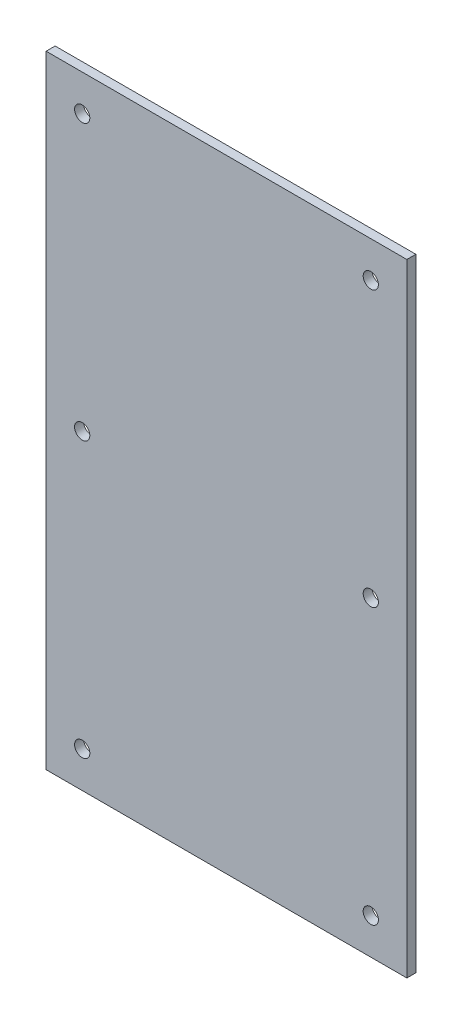
ISO-10303-21;
HEADER;
FILE_DESCRIPTION(('STEP AP214'),'2;1');
FILE_NAME('part.step','',(''),(''),'','','');
FILE_SCHEMA(('AUTOMOTIVE_DESIGN { 1 0 10303 214 1 1 1 1 }'));
ENDSEC;
DATA;
#1=APPLICATION_CONTEXT('core data for automotive mechanical design processes');
#2=APPLICATION_PROTOCOL_DEFINITION('international standard','automotive_design',2000,#1);
#3=PRODUCT_CONTEXT('',#1,'mechanical');
#4=PRODUCT('Part','Part','',(#3));
#5=PRODUCT_RELATED_PRODUCT_CATEGORY('part','',(#4));
#6=PRODUCT_DEFINITION_FORMATION('','',#4);
#7=PRODUCT_DEFINITION_CONTEXT('part definition',#1,'design');
#8=PRODUCT_DEFINITION('design','',#6,#7);
#9=PRODUCT_DEFINITION_SHAPE('','',#8);
#10=(LENGTH_UNIT() NAMED_UNIT(*) SI_UNIT(.MILLI.,.METRE.));
#11=(NAMED_UNIT(*) PLANE_ANGLE_UNIT() SI_UNIT($,.RADIAN.));
#12=(NAMED_UNIT(*) SI_UNIT($,.STERADIAN.) SOLID_ANGLE_UNIT());
#13=UNCERTAINTY_MEASURE_WITH_UNIT(LENGTH_MEASURE(1.E-05),#10,'distance_accuracy_value','');
#14=(GEOMETRIC_REPRESENTATION_CONTEXT(3) GLOBAL_UNCERTAINTY_ASSIGNED_CONTEXT((#13)) GLOBAL_UNIT_ASSIGNED_CONTEXT((#10,
#11,#12)) REPRESENTATION_CONTEXT('',''));
#15=CARTESIAN_POINT('',(0.,0.,0.));
#16=DIRECTION('',(0.,0.,1.));
#17=DIRECTION('',(1.,0.,0.));
#18=AXIS2_PLACEMENT_3D('',#15,#16,#17);
#19=CARTESIAN_POINT('',(127.,219.075,6.35));
#20=DIRECTION('',(-1.,0.,0.));
#21=DIRECTION('',(0.,-1.,0.));
#22=AXIS2_PLACEMENT_3D('',#19,#20,#21);
#23=PLANE('',#22);
#24=DIRECTION('',(0.,1.,0.));
#25=VECTOR('',#24,1.);
#26=CARTESIAN_POINT('',(127.,219.075,0.));
#27=LINE('',#26,#25);
#28=CARTESIAN_POINT('',(127.,-219.075,0.));
#29=VERTEX_POINT('',#28);
#30=CARTESIAN_POINT('',(127.,219.075,0.));
#31=VERTEX_POINT('',#30);
#32=EDGE_CURVE('E97',#29,#31,#27,.T.);
#33=ORIENTED_EDGE('',*,*,#32,.T.);
#34=DIRECTION('',(0.,0.,-1.));
#35=VECTOR('',#34,1.);
#36=CARTESIAN_POINT('',(127.,219.075,6.35));
#37=LINE('',#36,#35);
#38=CARTESIAN_POINT('',(127.,219.075,6.35));
#39=VERTEX_POINT('',#38);
#40=EDGE_CURVE('E11',#39,#31,#37,.T.);
#41=ORIENTED_EDGE('',*,*,#40,.F.);
#42=DIRECTION('',(0.,1.,0.));
#43=VECTOR('',#42,1.);
#44=CARTESIAN_POINT('',(127.,219.075,6.35));
#45=LINE('',#44,#43);
#46=CARTESIAN_POINT('',(127.,-219.075,6.35));
#47=VERTEX_POINT('',#46);
#48=EDGE_CURVE('E85',#47,#39,#45,.T.);
#49=ORIENTED_EDGE('',*,*,#48,.F.);
#50=DIRECTION('',(0.,0.,-1.));
#51=VECTOR('',#50,1.);
#52=CARTESIAN_POINT('',(127.,-219.075,6.35));
#53=LINE('',#52,#51);
#54=EDGE_CURVE('E93',#47,#29,#53,.T.);
#55=ORIENTED_EDGE('',*,*,#54,.T.);
#56=EDGE_LOOP('',(#33,#41,#49,#55));
#57=FACE_BOUND('',#56,.T.);
#58=ADVANCED_FACE('F34',(#57),#23,.F.);
#59=CARTESIAN_POINT('',(-127.,219.075,6.35));
#60=DIRECTION('',(0.,-1.,0.));
#61=DIRECTION('',(0.,0.,-1.));
#62=AXIS2_PLACEMENT_3D('',#59,#60,#61);
#63=PLANE('',#62);
#64=DIRECTION('',(-1.,0.,0.));
#65=VECTOR('',#64,1.);
#66=CARTESIAN_POINT('',(-127.,219.075,0.));
#67=LINE('',#66,#65);
#68=CARTESIAN_POINT('',(-127.,219.075,0.));
#69=VERTEX_POINT('',#68);
#70=EDGE_CURVE('E89',#31,#69,#67,.T.);
#71=ORIENTED_EDGE('',*,*,#70,.T.);
#72=DIRECTION('',(0.,0.,-1.));
#73=VECTOR('',#72,1.);
#74=CARTESIAN_POINT('',(-127.,219.075,6.35));
#75=LINE('',#74,#73);
#76=CARTESIAN_POINT('',(-127.,219.075,6.35));
#77=VERTEX_POINT('',#76);
#78=EDGE_CURVE('E42',#77,#69,#75,.T.);
#79=ORIENTED_EDGE('',*,*,#78,.F.);
#80=DIRECTION('',(-1.,0.,0.));
#81=VECTOR('',#80,1.);
#82=CARTESIAN_POINT('',(-127.,219.075,6.35));
#83=LINE('',#82,#81);
#84=EDGE_CURVE('E80',#39,#77,#83,.T.);
#85=ORIENTED_EDGE('',*,*,#84,.F.);
#86=ORIENTED_EDGE('',*,*,#40,.T.);
#87=EDGE_LOOP('',(#71,#79,#85,#86));
#88=FACE_BOUND('',#87,.T.);
#89=ADVANCED_FACE('F88',(#88),#63,.F.);
#90=CARTESIAN_POINT('',(-127.,219.075,6.35));
#91=DIRECTION('',(1.,0.,0.));
#92=DIRECTION('',(0.,1.,0.));
#93=AXIS2_PLACEMENT_3D('',#90,#91,#92);
#94=PLANE('',#93);
#95=DIRECTION('',(0.,-1.,0.));
#96=VECTOR('',#95,1.);
#97=CARTESIAN_POINT('',(-127.,219.075,0.));
#98=LINE('',#97,#96);
#99=CARTESIAN_POINT('',(-127.,-219.075,0.));
#100=VERTEX_POINT('',#99);
#101=EDGE_CURVE('E67',#69,#100,#98,.T.);
#102=ORIENTED_EDGE('',*,*,#101,.T.);
#103=DIRECTION('',(0.,0.,-1.));
#104=VECTOR('',#103,1.);
#105=CARTESIAN_POINT('',(-127.,-219.075,6.35));
#106=LINE('',#105,#104);
#107=CARTESIAN_POINT('',(-127.,-219.075,6.35));
#108=VERTEX_POINT('',#107);
#109=EDGE_CURVE('E90',#108,#100,#106,.T.);
#110=ORIENTED_EDGE('',*,*,#109,.F.);
#111=DIRECTION('',(0.,-1.,0.));
#112=VECTOR('',#111,1.);
#113=CARTESIAN_POINT('',(-127.,219.075,6.35));
#114=LINE('',#113,#112);
#115=EDGE_CURVE('E83',#77,#108,#114,.T.);
#116=ORIENTED_EDGE('',*,*,#115,.F.);
#117=ORIENTED_EDGE('',*,*,#78,.T.);
#118=EDGE_LOOP('',(#102,#110,#116,#117));
#119=FACE_BOUND('',#118,.T.);
#120=ADVANCED_FACE('F91',(#119),#94,.F.);
#121=CARTESIAN_POINT('',(-127.,-219.075,6.35));
#122=DIRECTION('',(0.,1.,0.));
#123=DIRECTION('',(0.,0.,1.));
#124=AXIS2_PLACEMENT_3D('',#121,#122,#123);
#125=PLANE('',#124);
#126=DIRECTION('',(1.,0.,0.));
#127=VECTOR('',#126,1.);
#128=CARTESIAN_POINT('',(-127.,-219.075,0.));
#129=LINE('',#128,#127);
#130=EDGE_CURVE('E73',#100,#29,#129,.T.);
#131=ORIENTED_EDGE('',*,*,#130,.T.);
#132=ORIENTED_EDGE('',*,*,#54,.F.);
#133=DIRECTION('',(1.,0.,0.));
#134=VECTOR('',#133,1.);
#135=CARTESIAN_POINT('',(-127.,-219.075,6.35));
#136=LINE('',#135,#134);
#137=EDGE_CURVE('E50',#108,#47,#136,.T.);
#138=ORIENTED_EDGE('',*,*,#137,.F.);
#139=ORIENTED_EDGE('',*,*,#109,.T.);
#140=EDGE_LOOP('',(#131,#132,#138,#139));
#141=FACE_BOUND('',#140,.T.);
#142=ADVANCED_FACE('F105',(#141),#125,.F.);
#143=CARTESIAN_POINT('',(0.,0.,6.35));
#144=DIRECTION('',(0.,0.,1.));
#145=DIRECTION('',(1.,0.,0.));
#146=AXIS2_PLACEMENT_3D('',#143,#144,#145);
#147=PLANE('',#146);
#148=CARTESIAN_POINT('',(-101.6,193.675,6.35));
#149=DIRECTION('',(0.,0.,1.));
#150=DIRECTION('',(1.,0.,0.));
#151=AXIS2_PLACEMENT_3D('',#148,#149,#150);
#152=CIRCLE('',#151,5.357876);
#153=CARTESIAN_POINT('',(-96.242124,193.675,6.35));
#154=VERTEX_POINT('',#153);
#155=EDGE_CURVE('E143',#154,#154,#152,.T.);
#156=ORIENTED_EDGE('',*,*,#155,.F.);
#157=EDGE_LOOP('',(#156));
#158=FACE_BOUND('',#157,.T.);
#159=CARTESIAN_POINT('',(-101.6,0.,6.35));
#160=DIRECTION('',(0.,0.,1.));
#161=DIRECTION('',(1.,0.,0.));
#162=AXIS2_PLACEMENT_3D('',#159,#160,#161);
#163=CIRCLE('',#162,5.357876);
#164=CARTESIAN_POINT('',(-96.242124,0.,6.35));
#165=VERTEX_POINT('',#164);
#166=EDGE_CURVE('E137',#165,#165,#163,.T.);
#167=ORIENTED_EDGE('',*,*,#166,.F.);
#168=EDGE_LOOP('',(#167));
#169=FACE_BOUND('',#168,.T.);
#170=CARTESIAN_POINT('',(-101.6,-193.675,6.35));
#171=DIRECTION('',(0.,0.,1.));
#172=DIRECTION('',(1.,0.,0.));
#173=AXIS2_PLACEMENT_3D('',#170,#171,#172);
#174=CIRCLE('',#173,5.357876);
#175=CARTESIAN_POINT('',(-96.242124,-193.675,6.35));
#176=VERTEX_POINT('',#175);
#177=EDGE_CURVE('E131',#176,#176,#174,.T.);
#178=ORIENTED_EDGE('',*,*,#177,.F.);
#179=EDGE_LOOP('',(#178));
#180=FACE_BOUND('',#179,.T.);
#181=CARTESIAN_POINT('',(101.6,193.675,6.35));
#182=DIRECTION('',(0.,0.,1.));
#183=DIRECTION('',(1.,0.,0.));
#184=AXIS2_PLACEMENT_3D('',#181,#182,#183);
#185=CIRCLE('',#184,5.357876);
#186=CARTESIAN_POINT('',(106.957876,193.675,6.35));
#187=VERTEX_POINT('',#186);
#188=EDGE_CURVE('E125',#187,#187,#185,.T.);
#189=ORIENTED_EDGE('',*,*,#188,.F.);
#190=EDGE_LOOP('',(#189));
#191=FACE_BOUND('',#190,.T.);
#192=CARTESIAN_POINT('',(101.6,0.,6.35));
#193=DIRECTION('',(0.,0.,1.));
#194=DIRECTION('',(1.,0.,0.));
#195=AXIS2_PLACEMENT_3D('',#192,#193,#194);
#196=CIRCLE('',#195,5.357876);
#197=CARTESIAN_POINT('',(106.957876,0.,6.35));
#198=VERTEX_POINT('',#197);
#199=EDGE_CURVE('E119',#198,#198,#196,.T.);
#200=ORIENTED_EDGE('',*,*,#199,.F.);
#201=EDGE_LOOP('',(#200));
#202=FACE_BOUND('',#201,.T.);
#203=CARTESIAN_POINT('',(101.6,-193.675,6.35));
#204=DIRECTION('',(0.,0.,1.));
#205=DIRECTION('',(1.,0.,0.));
#206=AXIS2_PLACEMENT_3D('',#203,#204,#205);
#207=CIRCLE('',#206,5.357876);
#208=CARTESIAN_POINT('',(106.957876,-193.675,6.35));
#209=VERTEX_POINT('',#208);
#210=EDGE_CURVE('E113',#209,#209,#207,.T.);
#211=ORIENTED_EDGE('',*,*,#210,.F.);
#212=EDGE_LOOP('',(#211));
#213=FACE_BOUND('',#212,.T.);
#214=ORIENTED_EDGE('',*,*,#48,.T.);
#215=ORIENTED_EDGE('',*,*,#84,.T.);
#216=ORIENTED_EDGE('',*,*,#115,.T.);
#217=ORIENTED_EDGE('',*,*,#137,.T.);
#218=EDGE_LOOP('',(#214,#215,#216,#217));
#219=FACE_BOUND('',#218,.T.);
#220=ADVANCED_FACE('F81',(#158,#169,#180,#191,#202,#213,#219),#147,.T.);
#221=CARTESIAN_POINT('',(0.,0.,0.));
#222=DIRECTION('',(0.,0.,1.));
#223=DIRECTION('',(1.,0.,0.));
#224=AXIS2_PLACEMENT_3D('',#221,#222,#223);
#225=PLANE('',#224);
#226=CARTESIAN_POINT('',(-101.6,193.675,0.));
#227=DIRECTION('',(0.,0.,1.));
#228=DIRECTION('',(1.,0.,0.));
#229=AXIS2_PLACEMENT_3D('',#226,#227,#228);
#230=CIRCLE('',#229,5.357876);
#231=CARTESIAN_POINT('',(-96.242124,193.675,0.));
#232=VERTEX_POINT('',#231);
#233=EDGE_CURVE('E140',#232,#232,#230,.T.);
#234=ORIENTED_EDGE('',*,*,#233,.T.);
#235=EDGE_LOOP('',(#234));
#236=FACE_BOUND('',#235,.T.);
#237=CARTESIAN_POINT('',(-101.6,0.,0.));
#238=DIRECTION('',(0.,0.,1.));
#239=DIRECTION('',(1.,0.,0.));
#240=AXIS2_PLACEMENT_3D('',#237,#238,#239);
#241=CIRCLE('',#240,5.357876);
#242=CARTESIAN_POINT('',(-96.242124,0.,0.));
#243=VERTEX_POINT('',#242);
#244=EDGE_CURVE('E134',#243,#243,#241,.T.);
#245=ORIENTED_EDGE('',*,*,#244,.T.);
#246=EDGE_LOOP('',(#245));
#247=FACE_BOUND('',#246,.T.);
#248=CARTESIAN_POINT('',(-101.6,-193.675,0.));
#249=DIRECTION('',(0.,0.,1.));
#250=DIRECTION('',(1.,0.,0.));
#251=AXIS2_PLACEMENT_3D('',#248,#249,#250);
#252=CIRCLE('',#251,5.357876);
#253=CARTESIAN_POINT('',(-96.242124,-193.675,0.));
#254=VERTEX_POINT('',#253);
#255=EDGE_CURVE('E128',#254,#254,#252,.T.);
#256=ORIENTED_EDGE('',*,*,#255,.T.);
#257=EDGE_LOOP('',(#256));
#258=FACE_BOUND('',#257,.T.);
#259=CARTESIAN_POINT('',(101.6,193.675,0.));
#260=DIRECTION('',(0.,0.,1.));
#261=DIRECTION('',(1.,0.,0.));
#262=AXIS2_PLACEMENT_3D('',#259,#260,#261);
#263=CIRCLE('',#262,5.357876);
#264=CARTESIAN_POINT('',(106.957876,193.675,0.));
#265=VERTEX_POINT('',#264);
#266=EDGE_CURVE('E122',#265,#265,#263,.T.);
#267=ORIENTED_EDGE('',*,*,#266,.T.);
#268=EDGE_LOOP('',(#267));
#269=FACE_BOUND('',#268,.T.);
#270=CARTESIAN_POINT('',(101.6,0.,0.));
#271=DIRECTION('',(0.,0.,1.));
#272=DIRECTION('',(1.,0.,0.));
#273=AXIS2_PLACEMENT_3D('',#270,#271,#272);
#274=CIRCLE('',#273,5.357876);
#275=CARTESIAN_POINT('',(106.957876,0.,0.));
#276=VERTEX_POINT('',#275);
#277=EDGE_CURVE('E116',#276,#276,#274,.T.);
#278=ORIENTED_EDGE('',*,*,#277,.T.);
#279=EDGE_LOOP('',(#278));
#280=FACE_BOUND('',#279,.T.);
#281=CARTESIAN_POINT('',(101.6,-193.675,0.));
#282=DIRECTION('',(0.,0.,1.));
#283=DIRECTION('',(1.,0.,0.));
#284=AXIS2_PLACEMENT_3D('',#281,#282,#283);
#285=CIRCLE('',#284,5.357876);
#286=CARTESIAN_POINT('',(106.957876,-193.675,0.));
#287=VERTEX_POINT('',#286);
#288=EDGE_CURVE('E100',#287,#287,#285,.T.);
#289=ORIENTED_EDGE('',*,*,#288,.T.);
#290=EDGE_LOOP('',(#289));
#291=FACE_BOUND('',#290,.T.);
#292=ORIENTED_EDGE('',*,*,#32,.F.);
#293=ORIENTED_EDGE('',*,*,#130,.F.);
#294=ORIENTED_EDGE('',*,*,#101,.F.);
#295=ORIENTED_EDGE('',*,*,#70,.F.);
#296=EDGE_LOOP('',(#292,#293,#294,#295));
#297=FACE_BOUND('',#296,.T.);
#298=ADVANCED_FACE('F108',(#236,#247,#258,#269,#280,#291,#297),#225,.F.);
#299=CARTESIAN_POINT('',(101.6,-193.675,6.35));
#300=DIRECTION('',(0.,0.,1.));
#301=DIRECTION('',(1.,0.,0.));
#302=AXIS2_PLACEMENT_3D('',#299,#300,#301);
#303=CYLINDRICAL_SURFACE('',#302,5.357876);
#304=ORIENTED_EDGE('',*,*,#288,.F.);
#305=EDGE_LOOP('',(#304));
#306=FACE_BOUND('',#305,.T.);
#307=ORIENTED_EDGE('',*,*,#210,.T.);
#308=EDGE_LOOP('',(#307));
#309=FACE_BOUND('',#308,.T.);
#310=ADVANCED_FACE('F162',(#306,#309),#303,.F.);
#311=CARTESIAN_POINT('',(101.6,0.,6.35));
#312=DIRECTION('',(0.,0.,1.));
#313=DIRECTION('',(1.,0.,0.));
#314=AXIS2_PLACEMENT_3D('',#311,#312,#313);
#315=CYLINDRICAL_SURFACE('',#314,5.357876);
#316=ORIENTED_EDGE('',*,*,#277,.F.);
#317=EDGE_LOOP('',(#316));
#318=FACE_BOUND('',#317,.T.);
#319=ORIENTED_EDGE('',*,*,#199,.T.);
#320=EDGE_LOOP('',(#319));
#321=FACE_BOUND('',#320,.T.);
#322=ADVANCED_FACE('F164',(#318,#321),#315,.F.);
#323=CARTESIAN_POINT('',(101.6,193.675,6.35));
#324=DIRECTION('',(0.,0.,1.));
#325=DIRECTION('',(1.,0.,0.));
#326=AXIS2_PLACEMENT_3D('',#323,#324,#325);
#327=CYLINDRICAL_SURFACE('',#326,5.357876);
#328=ORIENTED_EDGE('',*,*,#266,.F.);
#329=EDGE_LOOP('',(#328));
#330=FACE_BOUND('',#329,.T.);
#331=ORIENTED_EDGE('',*,*,#188,.T.);
#332=EDGE_LOOP('',(#331));
#333=FACE_BOUND('',#332,.T.);
#334=ADVANCED_FACE('F171',(#330,#333),#327,.F.);
#335=CARTESIAN_POINT('',(-101.6,-193.675,6.35));
#336=DIRECTION('',(0.,0.,1.));
#337=DIRECTION('',(1.,0.,0.));
#338=AXIS2_PLACEMENT_3D('',#335,#336,#337);
#339=CYLINDRICAL_SURFACE('',#338,5.357876);
#340=ORIENTED_EDGE('',*,*,#255,.F.);
#341=EDGE_LOOP('',(#340));
#342=FACE_BOUND('',#341,.T.);
#343=ORIENTED_EDGE('',*,*,#177,.T.);
#344=EDGE_LOOP('',(#343));
#345=FACE_BOUND('',#344,.T.);
#346=ADVANCED_FACE('F227',(#342,#345),#339,.F.);
#347=CARTESIAN_POINT('',(-101.6,0.,6.35));
#348=DIRECTION('',(0.,0.,1.));
#349=DIRECTION('',(1.,0.,0.));
#350=AXIS2_PLACEMENT_3D('',#347,#348,#349);
#351=CYLINDRICAL_SURFACE('',#350,5.357876);
#352=ORIENTED_EDGE('',*,*,#244,.F.);
#353=EDGE_LOOP('',(#352));
#354=FACE_BOUND('',#353,.T.);
#355=ORIENTED_EDGE('',*,*,#166,.T.);
#356=EDGE_LOOP('',(#355));
#357=FACE_BOUND('',#356,.T.);
#358=ADVANCED_FACE('F236',(#354,#357),#351,.F.);
#359=CARTESIAN_POINT('',(-101.6,193.675,6.35));
#360=DIRECTION('',(0.,0.,1.));
#361=DIRECTION('',(1.,0.,0.));
#362=AXIS2_PLACEMENT_3D('',#359,#360,#361);
#363=CYLINDRICAL_SURFACE('',#362,5.357876);
#364=ORIENTED_EDGE('',*,*,#233,.F.);
#365=EDGE_LOOP('',(#364));
#366=FACE_BOUND('',#365,.T.);
#367=ORIENTED_EDGE('',*,*,#155,.T.);
#368=EDGE_LOOP('',(#367));
#369=FACE_BOUND('',#368,.T.);
#370=ADVANCED_FACE('F147',(#366,#369),#363,.F.);
#371=CLOSED_SHELL('',(#58,#89,#120,#142,#220,#298,#310,#322,#334,#346,#358,#370));
#372=MANIFOLD_SOLID_BREP('B2',#371);
#373=ADVANCED_BREP_SHAPE_REPRESENTATION('',(#18,#372),#14);
#374=SHAPE_DEFINITION_REPRESENTATION(#9,#373);
ENDSEC;
END-ISO-10303-21;
